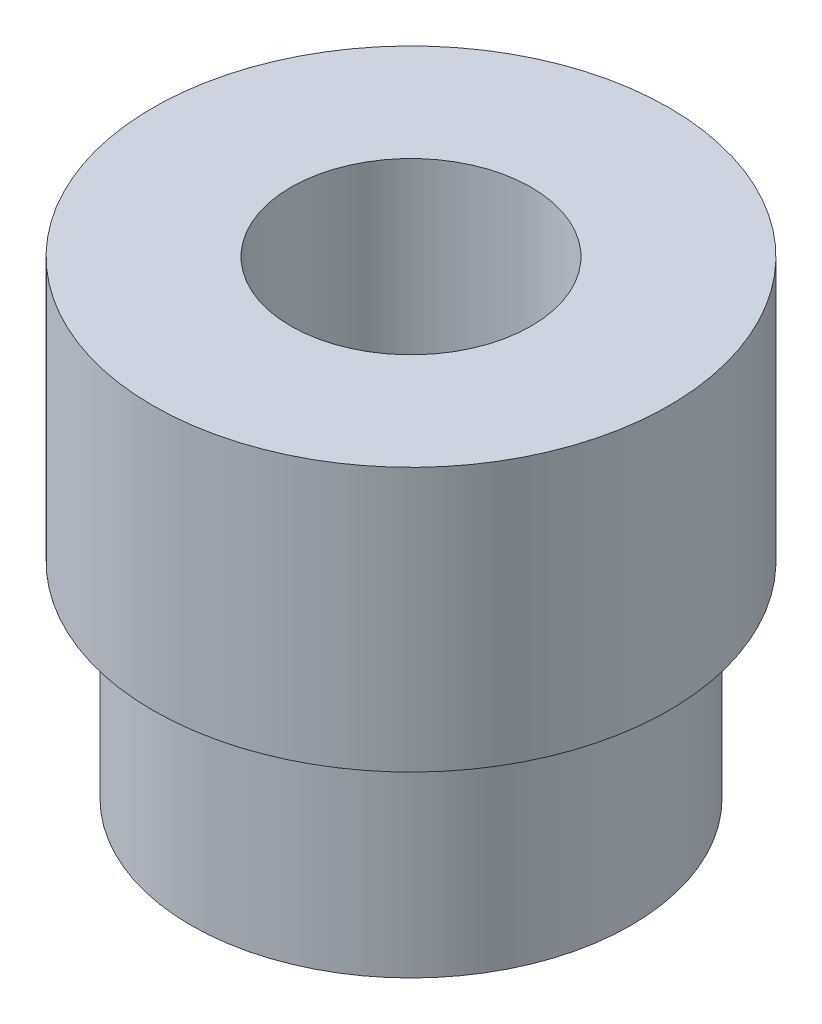
ISO-10303-21;
HEADER;
FILE_DESCRIPTION(('STEP AP214'),'2;1');
FILE_NAME('part.step','',(''),(''),'','','');
FILE_SCHEMA(('AUTOMOTIVE_DESIGN { 1 0 10303 214 1 1 1 1 }'));
ENDSEC;
DATA;
#1=APPLICATION_CONTEXT('core data for automotive mechanical design processes');
#2=APPLICATION_PROTOCOL_DEFINITION('international standard','automotive_design',2000,#1);
#3=PRODUCT_CONTEXT('',#1,'mechanical');
#4=PRODUCT('Part','Part','',(#3));
#5=PRODUCT_RELATED_PRODUCT_CATEGORY('part','',(#4));
#6=PRODUCT_DEFINITION_FORMATION('','',#4);
#7=PRODUCT_DEFINITION_CONTEXT('part definition',#1,'design');
#8=PRODUCT_DEFINITION('design','',#6,#7);
#9=PRODUCT_DEFINITION_SHAPE('','',#8);
#10=(LENGTH_UNIT() NAMED_UNIT(*) SI_UNIT(.MILLI.,.METRE.));
#11=(NAMED_UNIT(*) PLANE_ANGLE_UNIT() SI_UNIT($,.RADIAN.));
#12=(NAMED_UNIT(*) SI_UNIT($,.STERADIAN.) SOLID_ANGLE_UNIT());
#13=UNCERTAINTY_MEASURE_WITH_UNIT(LENGTH_MEASURE(1.E-05),#10,'distance_accuracy_value','');
#14=(GEOMETRIC_REPRESENTATION_CONTEXT(3) GLOBAL_UNCERTAINTY_ASSIGNED_CONTEXT((#13)) GLOBAL_UNIT_ASSIGNED_CONTEXT((#10,
#11,#12)) REPRESENTATION_CONTEXT('',''));
#15=CARTESIAN_POINT('',(0.,0.,0.));
#16=DIRECTION('',(0.,0.,1.));
#17=DIRECTION('',(1.,0.,0.));
#18=AXIS2_PLACEMENT_3D('',#15,#16,#17);
#19=CARTESIAN_POINT('',(0.,0.,0.));
#20=DIRECTION('',(0.,1.,0.));
#21=DIRECTION('',(0.,0.,1.));
#22=AXIS2_PLACEMENT_3D('',#19,#20,#21);
#23=PLANE('',#22);
#24=CARTESIAN_POINT('',(0.,0.,0.));
#25=DIRECTION('',(0.,-1.,0.));
#26=DIRECTION('',(0.,0.,-1.));
#27=AXIS2_PLACEMENT_3D('',#24,#25,#26);
#28=CIRCLE('',#27,7.5);
#29=CARTESIAN_POINT('',(0.,0.,-7.5));
#30=VERTEX_POINT('',#29);
#31=EDGE_CURVE('E58',#30,#30,#28,.T.);
#32=ORIENTED_EDGE('',*,*,#31,.T.);
#33=EDGE_LOOP('',(#32));
#34=FACE_BOUND('',#33,.T.);
#35=CARTESIAN_POINT('',(0.,0.,0.));
#36=DIRECTION('',(0.,-1.,0.));
#37=DIRECTION('',(0.,0.,-1.));
#38=AXIS2_PLACEMENT_3D('',#35,#36,#37);
#39=CIRCLE('',#38,4.1);
#40=CARTESIAN_POINT('',(0.,0.,-4.1));
#41=VERTEX_POINT('',#40);
#42=EDGE_CURVE('E70',#41,#41,#39,.T.);
#43=ORIENTED_EDGE('',*,*,#42,.F.);
#44=EDGE_LOOP('',(#43));
#45=FACE_BOUND('',#44,.T.);
#46=ADVANCED_FACE('F48',(#34,#45),#23,.F.);
#47=CARTESIAN_POINT('',(0.,7.,0.));
#48=DIRECTION('',(0.,1.,0.));
#49=DIRECTION('',(0.,0.,1.));
#50=AXIS2_PLACEMENT_3D('',#47,#48,#49);
#51=CYLINDRICAL_SURFACE('',#50,8.8);
#52=CARTESIAN_POINT('',(0.,7.,0.));
#53=DIRECTION('',(0.,1.,0.));
#54=DIRECTION('',(0.,0.,1.));
#55=AXIS2_PLACEMENT_3D('',#52,#53,#54);
#56=CIRCLE('',#55,8.8);
#57=CARTESIAN_POINT('',(0.,7.,8.8));
#58=VERTEX_POINT('',#57);
#59=EDGE_CURVE('E11',#58,#58,#56,.T.);
#60=ORIENTED_EDGE('',*,*,#59,.T.);
#61=EDGE_LOOP('',(#60));
#62=FACE_BOUND('',#61,.T.);
#63=CARTESIAN_POINT('',(0.,16.,0.));
#64=DIRECTION('',(0.,1.,0.));
#65=DIRECTION('',(0.,0.,1.));
#66=AXIS2_PLACEMENT_3D('',#63,#64,#65);
#67=CIRCLE('',#66,8.8);
#68=CARTESIAN_POINT('',(0.,16.,8.8));
#69=VERTEX_POINT('',#68);
#70=EDGE_CURVE('E54',#69,#69,#67,.T.);
#71=ORIENTED_EDGE('',*,*,#70,.F.);
#72=EDGE_LOOP('',(#71));
#73=FACE_BOUND('',#72,.T.);
#74=ADVANCED_FACE('F78',(#62,#73),#51,.T.);
#75=CARTESIAN_POINT('',(0.,7.,0.));
#76=DIRECTION('',(0.,1.,0.));
#77=DIRECTION('',(0.,0.,1.));
#78=AXIS2_PLACEMENT_3D('',#75,#76,#77);
#79=PLANE('',#78);
#80=CARTESIAN_POINT('',(0.,7.,0.));
#81=DIRECTION('',(0.,1.,0.));
#82=DIRECTION('',(0.,0.,1.));
#83=AXIS2_PLACEMENT_3D('',#80,#81,#82);
#84=CIRCLE('',#83,7.5);
#85=CARTESIAN_POINT('',(0.,7.,7.5));
#86=VERTEX_POINT('',#85);
#87=EDGE_CURVE('E62',#86,#86,#84,.F.);
#88=ORIENTED_EDGE('',*,*,#87,.F.);
#89=EDGE_LOOP('',(#88));
#90=FACE_BOUND('',#89,.T.);
#91=ORIENTED_EDGE('',*,*,#59,.F.);
#92=EDGE_LOOP('',(#91));
#93=FACE_BOUND('',#92,.T.);
#94=ADVANCED_FACE('F83',(#90,#93),#79,.F.);
#95=CARTESIAN_POINT('',(0.,16.,0.));
#96=DIRECTION('',(0.,1.,0.));
#97=DIRECTION('',(0.,0.,1.));
#98=AXIS2_PLACEMENT_3D('',#95,#96,#97);
#99=PLANE('',#98);
#100=ORIENTED_EDGE('',*,*,#70,.T.);
#101=EDGE_LOOP('',(#100));
#102=FACE_BOUND('',#101,.T.);
#103=CARTESIAN_POINT('',(0.,16.,0.));
#104=DIRECTION('',(0.,1.,0.));
#105=DIRECTION('',(0.,0.,1.));
#106=AXIS2_PLACEMENT_3D('',#103,#104,#105);
#107=CIRCLE('',#106,4.1);
#108=CARTESIAN_POINT('',(0.,16.,4.1));
#109=VERTEX_POINT('',#108);
#110=EDGE_CURVE('E67',#109,#109,#107,.F.);
#111=ORIENTED_EDGE('',*,*,#110,.T.);
#112=EDGE_LOOP('',(#111));
#113=FACE_BOUND('',#112,.T.);
#114=ADVANCED_FACE('F89',(#102,#113),#99,.T.);
#115=CARTESIAN_POINT('',(0.,16.002,0.));
#116=DIRECTION('',(0.,-1.,0.));
#117=DIRECTION('',(0.,0.,-1.));
#118=AXIS2_PLACEMENT_3D('',#115,#116,#117);
#119=CYLINDRICAL_SURFACE('',#118,7.5);
#120=ORIENTED_EDGE('',*,*,#31,.F.);
#121=EDGE_LOOP('',(#120));
#122=FACE_BOUND('',#121,.T.);
#123=ORIENTED_EDGE('',*,*,#87,.T.);
#124=EDGE_LOOP('',(#123));
#125=FACE_BOUND('',#124,.T.);
#126=ADVANCED_FACE('F86',(#122,#125),#119,.T.);
#127=CARTESIAN_POINT('',(0.,27.879393923934,0.));
#128=DIRECTION('',(0.,-1.,0.));
#129=DIRECTION('',(0.,0.,-1.));
#130=AXIS2_PLACEMENT_3D('',#127,#128,#129);
#131=CYLINDRICAL_SURFACE('',#130,4.1);
#132=ORIENTED_EDGE('',*,*,#42,.T.);
#133=EDGE_LOOP('',(#132));
#134=FACE_BOUND('',#133,.T.);
#135=ORIENTED_EDGE('',*,*,#110,.F.);
#136=EDGE_LOOP('',(#135));
#137=FACE_BOUND('',#136,.T.);
#138=ADVANCED_FACE('F74',(#134,#137),#131,.F.);
#139=CLOSED_SHELL('',(#46,#74,#94,#114,#126,#138));
#140=MANIFOLD_SOLID_BREP('B2',#139);
#141=ADVANCED_BREP_SHAPE_REPRESENTATION('',(#18,#140),#14);
#142=SHAPE_DEFINITION_REPRESENTATION(#9,#141);
ENDSEC;
END-ISO-10303-21;
